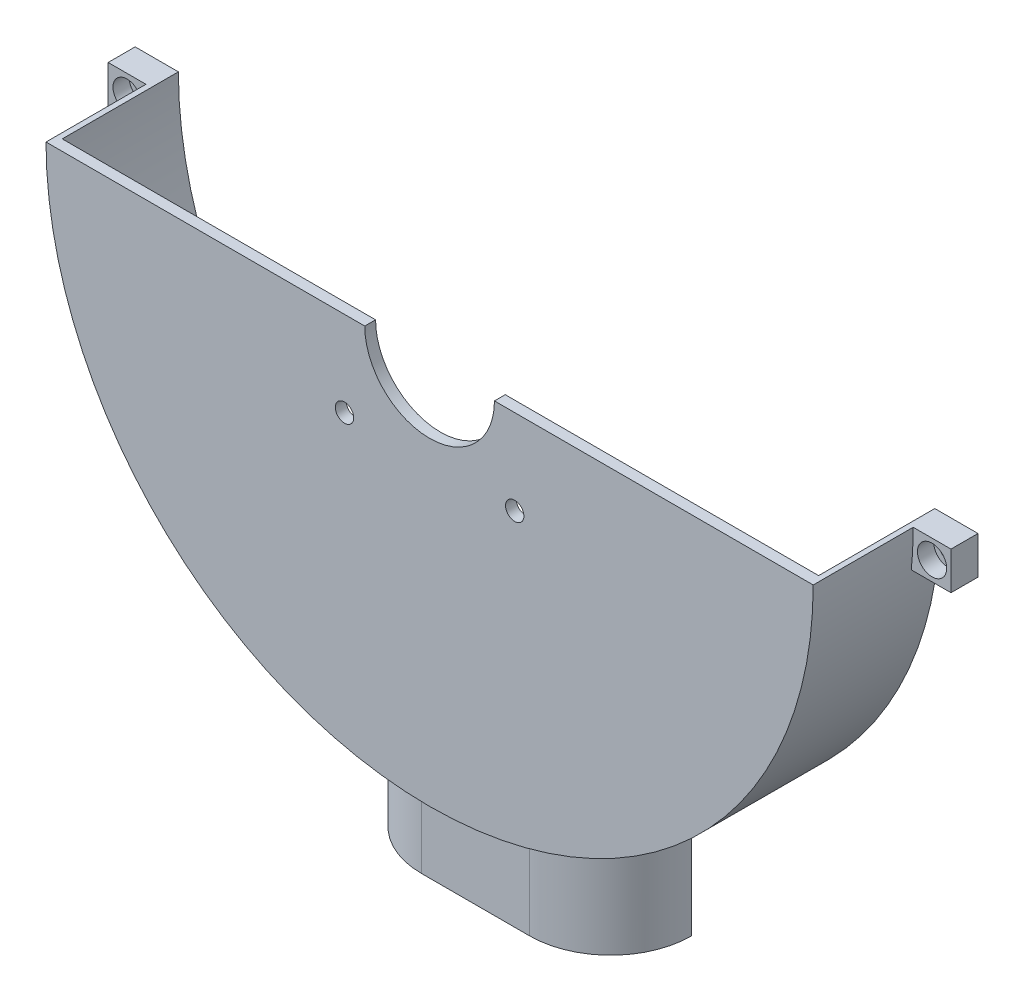
ISO-10303-21;
HEADER;
FILE_DESCRIPTION(('STEP AP214'),'2;1');
FILE_NAME('part.step','',(''),(''),'','','');
FILE_SCHEMA(('AUTOMOTIVE_DESIGN { 1 0 10303 214 1 1 1 1 }'));
ENDSEC;
DATA;
#1=APPLICATION_CONTEXT('core data for automotive mechanical design processes');
#2=APPLICATION_PROTOCOL_DEFINITION('international standard','automotive_design',2000,#1);
#3=PRODUCT_CONTEXT('',#1,'mechanical');
#4=PRODUCT('Part','Part','',(#3));
#5=PRODUCT_RELATED_PRODUCT_CATEGORY('part','',(#4));
#6=PRODUCT_DEFINITION_FORMATION('','',#4);
#7=PRODUCT_DEFINITION_CONTEXT('part definition',#1,'design');
#8=PRODUCT_DEFINITION('design','',#6,#7);
#9=PRODUCT_DEFINITION_SHAPE('','',#8);
#10=(LENGTH_UNIT() NAMED_UNIT(*) SI_UNIT(.MILLI.,.METRE.));
#11=(NAMED_UNIT(*) PLANE_ANGLE_UNIT() SI_UNIT($,.RADIAN.));
#12=(NAMED_UNIT(*) SI_UNIT($,.STERADIAN.) SOLID_ANGLE_UNIT());
#13=UNCERTAINTY_MEASURE_WITH_UNIT(LENGTH_MEASURE(1.E-05),#10,'distance_accuracy_value','');
#14=(GEOMETRIC_REPRESENTATION_CONTEXT(3) GLOBAL_UNCERTAINTY_ASSIGNED_CONTEXT((#13)) GLOBAL_UNIT_ASSIGNED_CONTEXT((#10,
#11,#12)) REPRESENTATION_CONTEXT('',''));
#15=CARTESIAN_POINT('',(0.,0.,0.));
#16=DIRECTION('',(0.,0.,1.));
#17=DIRECTION('',(1.,0.,0.));
#18=AXIS2_PLACEMENT_3D('',#15,#16,#17);
#19=CARTESIAN_POINT('',(0.,0.,21.5));
#20=DIRECTION('',(0.,1.,0.));
#21=DIRECTION('',(-1.,0.,0.));
#22=AXIS2_PLACEMENT_3D('',#19,#20,#21);
#23=PLANE('',#22);
#24=DIRECTION('',(0.,0.,1.));
#25=VECTOR('',#24,1.);
#26=CARTESIAN_POINT('',(-12.,0.,13.5));
#27=LINE('',#26,#25);
#28=CARTESIAN_POINT('',(-12.,0.,21.5));
#29=VERTEX_POINT('',#28);
#30=CARTESIAN_POINT('',(-12.,0.,23.5));
#31=VERTEX_POINT('',#30);
#32=EDGE_CURVE('E131',#29,#31,#27,.T.);
#33=ORIENTED_EDGE('',*,*,#32,.F.);
#34=DIRECTION('',(-1.,0.,0.));
#35=VECTOR('',#34,1.);
#36=CARTESIAN_POINT('',(0.,0.,21.5));
#37=LINE('',#36,#35);
#38=CARTESIAN_POINT('',(-70.,0.,21.5));
#39=VERTEX_POINT('',#38);
#40=EDGE_CURVE('E293',#29,#39,#37,.T.);
#41=ORIENTED_EDGE('',*,*,#40,.T.);
#42=DIRECTION('',(0.,0.,-1.));
#43=VECTOR('',#42,1.);
#44=CARTESIAN_POINT('',(-70.,0.,21.5));
#45=LINE('',#44,#43);
#46=CARTESIAN_POINT('',(-70.,0.,0.));
#47=VERTEX_POINT('',#46);
#48=EDGE_CURVE('E313',#39,#47,#45,.T.);
#49=ORIENTED_EDGE('',*,*,#48,.T.);
#50=DIRECTION('',(1.,0.,0.));
#51=VECTOR('',#50,1.);
#52=CARTESIAN_POINT('',(0.,0.,0.));
#53=LINE('',#52,#51);
#54=CARTESIAN_POINT('',(-78.,0.,0.));
#55=VERTEX_POINT('',#54);
#56=EDGE_CURVE('E300',#55,#47,#53,.T.);
#57=ORIENTED_EDGE('',*,*,#56,.F.);
#58=DIRECTION('',(0.,0.,-1.));
#59=VECTOR('',#58,1.);
#60=CARTESIAN_POINT('',(-78.,0.,5.));
#61=LINE('',#60,#59);
#62=CARTESIAN_POINT('',(-78.,0.,5.));
#63=VERTEX_POINT('',#62);
#64=EDGE_CURVE('E852',#63,#55,#61,.T.);
#65=ORIENTED_EDGE('',*,*,#64,.F.);
#66=DIRECTION('',(-1.,0.,0.));
#67=VECTOR('',#66,1.);
#68=CARTESIAN_POINT('',(-71.,-5.23545925731354E-13,5.));
#69=LINE('',#68,#67);
#70=CARTESIAN_POINT('',(-71.,0.,5.));
#71=VERTEX_POINT('',#70);
#72=EDGE_CURVE('E850',#71,#63,#69,.T.);
#73=ORIENTED_EDGE('',*,*,#72,.F.);
#74=DIRECTION('',(0.,0.,-1.));
#75=VECTOR('',#74,1.);
#76=CARTESIAN_POINT('',(-71.,0.,21.5));
#77=LINE('',#76,#75);
#78=CARTESIAN_POINT('',(-71.,0.,23.5));
#79=VERTEX_POINT('',#78);
#80=EDGE_CURVE('E311',#79,#71,#77,.T.);
#81=ORIENTED_EDGE('',*,*,#80,.F.);
#82=DIRECTION('',(-1.,0.,0.));
#83=VECTOR('',#82,1.);
#84=CARTESIAN_POINT('',(0.,0.,23.5));
#85=LINE('',#84,#83);
#86=EDGE_CURVE('E284',#31,#79,#85,.T.);
#87=ORIENTED_EDGE('',*,*,#86,.F.);
#88=EDGE_LOOP('',(#33,#41,#49,#57,#65,#73,#81,#87));
#89=FACE_BOUND('',#88,.T.);
#90=ADVANCED_FACE('F116',(#89),#23,.T.);
#91=CARTESIAN_POINT('',(0.,0.,0.));
#92=DIRECTION('',(0.,0.,1.));
#93=DIRECTION('',(1.,0.,0.));
#94=AXIS2_PLACEMENT_3D('',#91,#92,#93);
#95=PLANE('',#94);
#96=CARTESIAN_POINT('',(74.5,-3.49999999999999,0.));
#97=DIRECTION('',(0.,0.,-1.));
#98=DIRECTION('',(-1.,0.,0.));
#99=AXIS2_PLACEMENT_3D('',#96,#97,#98);
#100=CIRCLE('',#99,1.60000000000001);
#101=CARTESIAN_POINT('',(72.9,-3.49999999999999,0.));
#102=VERTEX_POINT('',#101);
#103=EDGE_CURVE('E867',#102,#102,#100,.T.);
#104=ORIENTED_EDGE('',*,*,#103,.F.);
#105=EDGE_LOOP('',(#104));
#106=FACE_BOUND('',#105,.T.);
#107=CARTESIAN_POINT('',(-74.5,-3.50000000000002,0.));
#108=DIRECTION('',(0.,0.,1.));
#109=DIRECTION('',(1.,0.,0.));
#110=AXIS2_PLACEMENT_3D('',#107,#108,#109);
#111=CIRCLE('',#110,1.60000000000001);
#112=CARTESIAN_POINT('',(-72.9,-3.50000000000002,0.));
#113=VERTEX_POINT('',#112);
#114=EDGE_CURVE('E323',#113,#113,#111,.T.);
#115=ORIENTED_EDGE('',*,*,#114,.T.);
#116=EDGE_LOOP('',(#115));
#117=FACE_BOUND('',#116,.T.);
#118=DIRECTION('',(0.,-1.,0.));
#119=VECTOR('',#118,1.);
#120=CARTESIAN_POINT('',(21.6189500386222,-71.,0.));
#121=LINE('',#120,#119);
#122=CARTESIAN_POINT('',(21.6189500386222,-71.,0.));
#123=VERTEX_POINT('',#122);
#124=CARTESIAN_POINT('',(21.6189500386222,-91.,0.));
#125=VERTEX_POINT('',#124);
#126=EDGE_CURVE('E939',#123,#125,#121,.T.);
#127=ORIENTED_EDGE('',*,*,#126,.F.);
#128=DIRECTION('',(1.,0.,0.));
#129=VECTOR('',#128,1.);
#130=CARTESIAN_POINT('',(0.,-71.,0.));
#131=LINE('',#130,#129);
#132=CARTESIAN_POINT('',(-21.6189500386223,-71.,0.));
#133=VERTEX_POINT('',#132);
#134=EDGE_CURVE('E971',#133,#123,#131,.T.);
#135=ORIENTED_EDGE('',*,*,#134,.F.);
#136=DIRECTION('',(0.,-1.,0.));
#137=VECTOR('',#136,1.);
#138=CARTESIAN_POINT('',(-21.6189500386223,-71.,0.));
#139=LINE('',#138,#137);
#140=CARTESIAN_POINT('',(-21.6189500386223,-91.,0.));
#141=VERTEX_POINT('',#140);
#142=EDGE_CURVE('E891',#133,#141,#139,.T.);
#143=ORIENTED_EDGE('',*,*,#142,.T.);
#144=DIRECTION('',(-1.,0.,0.));
#145=VECTOR('',#144,1.);
#146=CARTESIAN_POINT('',(0.,-91.,0.));
#147=LINE('',#146,#145);
#148=CARTESIAN_POINT('',(-25.,-91.,0.));
#149=VERTEX_POINT('',#148);
#150=EDGE_CURVE('E879',#141,#149,#147,.T.);
#151=ORIENTED_EDGE('',*,*,#150,.T.);
#152=DIRECTION('',(0.,1.,0.));
#153=VECTOR('',#152,1.);
#154=CARTESIAN_POINT('',(-25.,0.,0.));
#155=LINE('',#154,#153);
#156=CARTESIAN_POINT('',(-25.,-66.4529909033446,0.));
#157=VERTEX_POINT('',#156);
#158=EDGE_CURVE('E289',#149,#157,#155,.T.);
#159=ORIENTED_EDGE('',*,*,#158,.T.);
#160=CARTESIAN_POINT('',(0.,0.,0.));
#161=DIRECTION('',(0.,0.,1.));
#162=DIRECTION('',(1.,0.,0.));
#163=AXIS2_PLACEMENT_3D('',#160,#161,#162);
#164=CIRCLE('',#163,71.);
#165=CARTESIAN_POINT('',(-70.6540869306228,-7.00000000000003,0.));
#166=VERTEX_POINT('',#165);
#167=EDGE_CURVE('E304',#166,#157,#164,.T.);
#168=ORIENTED_EDGE('',*,*,#167,.F.);
#169=DIRECTION('',(1.,0.,0.));
#170=VECTOR('',#169,1.);
#171=CARTESIAN_POINT('',(-73.,-7.00000000000003,0.));
#172=LINE('',#171,#170);
#173=CARTESIAN_POINT('',(-78.,-7.00000000000003,0.));
#174=VERTEX_POINT('',#173);
#175=EDGE_CURVE('E854',#174,#166,#172,.T.);
#176=ORIENTED_EDGE('',*,*,#175,.F.);
#177=DIRECTION('',(0.,-1.,0.));
#178=VECTOR('',#177,1.);
#179=CARTESIAN_POINT('',(-78.,0.,0.));
#180=LINE('',#179,#178);
#181=EDGE_CURVE('E858',#55,#174,#180,.T.);
#182=ORIENTED_EDGE('',*,*,#181,.F.);
#183=ORIENTED_EDGE('',*,*,#56,.T.);
#184=CARTESIAN_POINT('',(0.,0.,0.));
#185=DIRECTION('',(0.,0.,1.));
#186=DIRECTION('',(1.,0.,0.));
#187=AXIS2_PLACEMENT_3D('',#184,#185,#186);
#188=CIRCLE('',#187,70.);
#189=CARTESIAN_POINT('',(70.,0.,0.));
#190=VERTEX_POINT('',#189);
#191=EDGE_CURVE('E286',#47,#190,#188,.T.);
#192=ORIENTED_EDGE('',*,*,#191,.T.);
#193=CARTESIAN_POINT('',(78.,0.,0.));
#194=VERTEX_POINT('',#193);
#195=EDGE_CURVE('E298',#190,#194,#53,.T.);
#196=ORIENTED_EDGE('',*,*,#195,.T.);
#197=DIRECTION('',(0.,-1.,0.));
#198=VECTOR('',#197,1.);
#199=CARTESIAN_POINT('',(78.,0.,0.));
#200=LINE('',#199,#198);
#201=CARTESIAN_POINT('',(78.,-7.,0.));
#202=VERTEX_POINT('',#201);
#203=EDGE_CURVE('E912',#194,#202,#200,.T.);
#204=ORIENTED_EDGE('',*,*,#203,.T.);
#205=DIRECTION('',(-1.,0.,0.));
#206=VECTOR('',#205,1.);
#207=CARTESIAN_POINT('',(0.,-7.,0.));
#208=LINE('',#207,#206);
#209=CARTESIAN_POINT('',(70.6540869306228,-7.,0.));
#210=VERTEX_POINT('',#209);
#211=EDGE_CURVE('E915',#202,#210,#208,.T.);
#212=ORIENTED_EDGE('',*,*,#211,.T.);
#213=CARTESIAN_POINT('',(25.,-66.4529909033446,0.));
#214=VERTEX_POINT('',#213);
#215=EDGE_CURVE('E303',#214,#210,#164,.T.);
#216=ORIENTED_EDGE('',*,*,#215,.F.);
#217=DIRECTION('',(0.,1.,0.));
#218=VECTOR('',#217,1.);
#219=CARTESIAN_POINT('',(25.,0.,0.));
#220=LINE('',#219,#218);
#221=CARTESIAN_POINT('',(25.,-91.,0.));
#222=VERTEX_POINT('',#221);
#223=EDGE_CURVE('E877',#222,#214,#220,.T.);
#224=ORIENTED_EDGE('',*,*,#223,.F.);
#225=EDGE_CURVE('E880',#222,#125,#147,.T.);
#226=ORIENTED_EDGE('',*,*,#225,.T.);
#227=EDGE_LOOP('',(#127,#135,#143,#151,#159,#168,#176,#182,#183,#192,#196,#204,#212,#216,#224,#226));
#228=FACE_BOUND('',#227,.T.);
#229=ADVANCED_FACE('F363',(#106,#117,#228),#95,.F.);
#230=CARTESIAN_POINT('',(0.,-91.,15.));
#231=DIRECTION('',(0.,-1.,0.));
#232=DIRECTION('',(0.,0.,-1.));
#233=AXIS2_PLACEMENT_3D('',#230,#231,#232);
#234=PLANE('',#233);
#235=CARTESIAN_POINT('',(10.,-91.,0.));
#236=DIRECTION('',(0.,-1.,0.));
#237=DIRECTION('',(0.,0.,-1.));
#238=AXIS2_PLACEMENT_3D('',#235,#236,#237);
#239=CIRCLE('',#238,12.);
#240=CARTESIAN_POINT('',(21.6189500386222,-91.,3.));
#241=VERTEX_POINT('',#240);
#242=CARTESIAN_POINT('',(10.,-91.,12.));
#243=VERTEX_POINT('',#242);
#244=EDGE_CURVE('E962',#241,#243,#239,.T.);
#245=ORIENTED_EDGE('',*,*,#244,.F.);
#246=DIRECTION('',(0.,0.,-1.));
#247=VECTOR('',#246,1.);
#248=CARTESIAN_POINT('',(21.6189500386222,-91.,0.));
#249=LINE('',#248,#247);
#250=EDGE_CURVE('E139',#241,#125,#249,.T.);
#251=ORIENTED_EDGE('',*,*,#250,.T.);
#252=ORIENTED_EDGE('',*,*,#225,.F.);
#253=CARTESIAN_POINT('',(10.,-91.,0.));
#254=DIRECTION('',(0.,-1.,0.));
#255=DIRECTION('',(0.,0.,-1.));
#256=AXIS2_PLACEMENT_3D('',#253,#254,#255);
#257=CIRCLE('',#256,15.);
#258=CARTESIAN_POINT('',(10.,-91.,15.));
#259=VERTEX_POINT('',#258);
#260=EDGE_CURVE('E328',#222,#259,#257,.T.);
#261=ORIENTED_EDGE('',*,*,#260,.T.);
#262=DIRECTION('',(-1.,0.,0.));
#263=VECTOR('',#262,1.);
#264=CARTESIAN_POINT('',(0.,-91.,15.));
#265=LINE('',#264,#263);
#266=CARTESIAN_POINT('',(-10.,-91.,15.));
#267=VERTEX_POINT('',#266);
#268=EDGE_CURVE('E871',#259,#267,#265,.T.);
#269=ORIENTED_EDGE('',*,*,#268,.T.);
#270=CARTESIAN_POINT('',(-10.,-91.,0.));
#271=DIRECTION('',(0.,-1.,0.));
#272=DIRECTION('',(0.,0.,-1.));
#273=AXIS2_PLACEMENT_3D('',#270,#271,#272);
#274=CIRCLE('',#273,15.);
#275=EDGE_CURVE('E330',#267,#149,#274,.T.);
#276=ORIENTED_EDGE('',*,*,#275,.T.);
#277=ORIENTED_EDGE('',*,*,#150,.F.);
#278=DIRECTION('',(0.,0.,-1.));
#279=VECTOR('',#278,1.);
#280=CARTESIAN_POINT('',(-21.6189500386223,-91.,0.));
#281=LINE('',#280,#279);
#282=CARTESIAN_POINT('',(-21.6189500386223,-91.,3.));
#283=VERTEX_POINT('',#282);
#284=EDGE_CURVE('E979',#283,#141,#281,.T.);
#285=ORIENTED_EDGE('',*,*,#284,.F.);
#286=CARTESIAN_POINT('',(-10.,-91.,0.));
#287=DIRECTION('',(0.,-1.,0.));
#288=DIRECTION('',(0.,0.,-1.));
#289=AXIS2_PLACEMENT_3D('',#286,#287,#288);
#290=CIRCLE('',#289,12.);
#291=CARTESIAN_POINT('',(-10.,-91.,12.));
#292=VERTEX_POINT('',#291);
#293=EDGE_CURVE('E976',#292,#283,#290,.T.);
#294=ORIENTED_EDGE('',*,*,#293,.F.);
#295=DIRECTION('',(-1.,0.,0.));
#296=VECTOR('',#295,1.);
#297=CARTESIAN_POINT('',(0.,-91.,12.));
#298=LINE('',#297,#296);
#299=EDGE_CURVE('E965',#243,#292,#298,.T.);
#300=ORIENTED_EDGE('',*,*,#299,.F.);
#301=EDGE_LOOP('',(#245,#251,#252,#261,#269,#276,#277,#285,#294,#300));
#302=FACE_BOUND('',#301,.T.);
#303=ADVANCED_FACE('F368',(#302),#234,.T.);
#304=CARTESIAN_POINT('',(-74.5,-3.50000000000002,5.));
#305=DIRECTION('',(0.,0.,-1.));
#306=DIRECTION('',(-1.,0.,0.));
#307=AXIS2_PLACEMENT_3D('',#304,#305,#306);
#308=CYLINDRICAL_SURFACE('',#307,1.60000000000001);
#309=ORIENTED_EDGE('',*,*,#114,.F.);
#310=EDGE_LOOP('',(#309));
#311=FACE_BOUND('',#310,.T.);
#312=CARTESIAN_POINT('',(-74.5,-3.50000000000002,2.));
#313=DIRECTION('',(0.,0.,1.));
#314=DIRECTION('',(1.,0.,0.));
#315=AXIS2_PLACEMENT_3D('',#312,#313,#314);
#316=CIRCLE('',#315,1.60000000000001);
#317=CARTESIAN_POINT('',(-72.9,-3.50000000000002,2.));
#318=VERTEX_POINT('',#317);
#319=EDGE_CURVE('E319',#318,#318,#316,.T.);
#320=ORIENTED_EDGE('',*,*,#319,.T.);
#321=EDGE_LOOP('',(#320));
#322=FACE_BOUND('',#321,.T.);
#323=ADVANCED_FACE('F380',(#311,#322),#308,.F.);
#324=CARTESIAN_POINT('',(74.5,-3.49999999999999,5.));
#325=DIRECTION('',(0.,0.,-1.));
#326=DIRECTION('',(-1.,0.,0.));
#327=AXIS2_PLACEMENT_3D('',#324,#325,#326);
#328=CYLINDRICAL_SURFACE('',#327,1.60000000000001);
#329=ORIENTED_EDGE('',*,*,#103,.T.);
#330=EDGE_LOOP('',(#329));
#331=FACE_BOUND('',#330,.T.);
#332=CARTESIAN_POINT('',(74.5,-3.49999999999999,2.));
#333=DIRECTION('',(0.,0.,1.));
#334=DIRECTION('',(1.,0.,0.));
#335=AXIS2_PLACEMENT_3D('',#332,#333,#334);
#336=CIRCLE('',#335,1.60000000000001);
#337=CARTESIAN_POINT('',(76.1,-3.49999999999999,2.));
#338=VERTEX_POINT('',#337);
#339=EDGE_CURVE('E316',#338,#338,#336,.F.);
#340=ORIENTED_EDGE('',*,*,#339,.F.);
#341=EDGE_LOOP('',(#340));
#342=FACE_BOUND('',#341,.T.);
#343=ADVANCED_FACE('F360',(#331,#342),#328,.F.);
#344=CARTESIAN_POINT('',(0.,0.,21.5));
#345=DIRECTION('',(0.,0.,-1.));
#346=DIRECTION('',(-1.,0.,0.));
#347=AXIS2_PLACEMENT_3D('',#344,#345,#346);
#348=CYLINDRICAL_SURFACE('',#347,71.);
#349=ORIENTED_EDGE('',*,*,#167,.T.);
#350=CARTESIAN_POINT('',(-25.,-66.4529909033446,0.));
#351=CARTESIAN_POINT('',(-25.0000005903524,-66.4529892917345,0.202890123291094));
#352=CARTESIAN_POINT('',(-24.9958827959298,-66.4545399945073,0.405754132783713));
#353=CARTESIAN_POINT('',(-24.9794283711578,-66.4607272766142,0.811094434555971));
#354=CARTESIAN_POINT('',(-24.9670920257694,-66.4653637489557,1.01357074003433));
#355=CARTESIAN_POINT('',(-24.917797028508,-66.4838680768963,1.61974669485583));
#356=CARTESIAN_POINT('',(-24.8685523791685,-66.5023308782734,2.02238403361912));
#357=CARTESIAN_POINT('',(-24.737993198442,-66.5510066828299,2.82038996686675));
#358=CARTESIAN_POINT('',(-24.6567755820139,-66.5811841731827,3.21577678312238));
#359=CARTESIAN_POINT('',(-24.4630499639891,-66.6526056042619,3.99780486330627));
#360=CARTESIAN_POINT('',(-24.3505410103259,-66.6938498817037,4.38444586074817));
#361=CARTESIAN_POINT('',(-24.0953419993637,-66.7864723363784,5.14612284370514));
#362=CARTESIAN_POINT('',(-23.9526689943176,-66.8378447868793,5.52116524936546));
#363=CARTESIAN_POINT('',(-23.638324992462,-66.9496631926846,6.25750406523527));
#364=CARTESIAN_POINT('',(-23.4666523229956,-67.0101096713426,6.61879968107707));
#365=CARTESIAN_POINT('',(-23.0956020324913,-67.1388987831489,7.325612948941));
#366=CARTESIAN_POINT('',(-22.8962112994059,-67.2072451507505,7.67112303022247));
#367=CARTESIAN_POINT('',(-22.4712659315399,-67.3505194327208,8.34421645846842));
#368=CARTESIAN_POINT('',(-22.2457107012023,-67.4254474968928,8.67179939712486));
#369=CARTESIAN_POINT('',(-21.7615525631412,-67.5832961350776,9.31851766812734));
#370=CARTESIAN_POINT('',(-21.5020617801036,-67.6664058484265,9.63694224659087));
#371=CARTESIAN_POINT('',(-20.9583899157298,-67.8367677003514,10.2509462698629));
#372=CARTESIAN_POINT('',(-20.6742009101862,-67.9240211643104,10.5465183247368));
#373=CARTESIAN_POINT('',(-20.0829901748955,-68.1011653816012,11.1130988985723));
#374=CARTESIAN_POINT('',(-19.7759650826353,-68.1910565221346,11.3841037870398));
#375=CARTESIAN_POINT('',(-19.1410012430146,-68.3720048524889,11.8999762900218));
#376=CARTESIAN_POINT('',(-18.8130617028942,-68.4630620864058,12.1448429128263));
#377=CARTESIAN_POINT('',(-18.1218416025611,-68.6493487369842,12.6182231879232));
#378=CARTESIAN_POINT('',(-17.7576183066252,-68.744566193301,12.845366685592));
#379=CARTESIAN_POINT('',(-17.0108165521357,-68.9331587207391,13.2677206815555));
#380=CARTESIAN_POINT('',(-16.6282441960605,-69.0265343900152,13.4629417025938));
#381=CARTESIAN_POINT('',(-15.8472721857437,-69.2100050478546,13.8200473386814));
#382=CARTESIAN_POINT('',(-15.4488785608921,-69.3001012615813,13.9819445105397));
#383=CARTESIAN_POINT('',(-14.6388107248533,-69.4757285989762,14.2711708026575));
#384=CARTESIAN_POINT('',(-14.2271392023012,-69.5612606376462,14.3985068726197));
#385=CARTESIAN_POINT('',(-13.5009067949091,-69.7052730446685,14.5892427530184));
#386=CARTESIAN_POINT('',(-13.1886811773013,-69.7650412692188,14.660662313501));
#387=CARTESIAN_POINT('',(-12.559703961304,-69.881013679575,14.7834554064761));
#388=CARTESIAN_POINT('',(-12.242953253642,-69.9372185552684,14.8348328292425));
#389=CARTESIAN_POINT('',(-11.6062572804768,-70.045691676637,14.9172020304908));
#390=CARTESIAN_POINT('',(-11.2863131375469,-70.0979612540486,14.9482007330017));
#391=CARTESIAN_POINT('',(-10.6443571537927,-70.1983170317084,14.9896100135823));
#392=CARTESIAN_POINT('',(-10.3223447877684,-70.2464021202939,15.0000151365729));
#393=CARTESIAN_POINT('',(-10.,-70.2922470831599,15.));
#394=B_SPLINE_CURVE_WITH_KNOTS('',3,(#350,#351,#352,#353,#354,#355,#356,#357,#358,#359,#360,
#361,#362,#363,#364,#365,#366,#367,#368,#369,#370,#371,#372,#373,#374,#375,#376,#377,#378,#379,
#380,#381,#382,#383,#384,#385,#386,#387,#388,#389,#390,#391,#392,#393),.UNSPECIFIED.,.F.,.F.,(4,
2,2,2,2,2,2,2,2,2,2,2,2,2,2,2,2,2,2,2,2,4),(0.,0.608570725485435,1.21712035115968,
2.43364958759041,3.6465193843696,4.85942608782073,6.07164893913068,7.28394173351149,
8.4968099677002,9.70970581465124,10.9655839571441,12.2218665352263,13.4783344629911,
14.7348500453823,16.052339464034,17.3693937136526,18.6859507698999,20.0022428904329,
20.9790765747016,21.9557205564564,22.9320325344798,23.9086030953595),.UNSPECIFIED.);
#395=CARTESIAN_POINT('',(-10.,-70.2922470831599,15.));
#396=VERTEX_POINT('',#395);
#397=EDGE_CURVE('E333',#157,#396,#394,.T.);
#398=ORIENTED_EDGE('',*,*,#397,.T.);
#399=CARTESIAN_POINT('',(0.,0.,15.));
#400=DIRECTION('',(0.,0.,-1.));
#401=DIRECTION('',(-1.,0.,0.));
#402=AXIS2_PLACEMENT_3D('',#399,#400,#401);
#403=CIRCLE('',#402,71.);
#404=CARTESIAN_POINT('',(10.,-70.2922470831599,15.));
#405=VERTEX_POINT('',#404);
#406=EDGE_CURVE('E874',#405,#396,#403,.T.);
#407=ORIENTED_EDGE('',*,*,#406,.F.);
#408=CARTESIAN_POINT('',(10.,-70.2922470831599,15.));
#409=CARTESIAN_POINT('',(10.2139363859511,-70.2618131813049,14.9999999695141));
#410=CARTESIAN_POINT('',(10.4277051094957,-70.2304036050421,14.9954224227743));
#411=CARTESIAN_POINT('',(10.8545616919083,-70.1656971947847,14.9771615807701));
#412=CARTESIAN_POINT('',(11.0676495677583,-70.1324004082562,14.9634785144299));
#413=CARTESIAN_POINT('',(11.7051948561132,-70.0298043608516,14.9088613094986));
#414=CARTESIAN_POINT('',(12.1281307104455,-69.9577713905516,14.8543590709993));
#415=CARTESIAN_POINT('',(12.9658575720154,-69.8073592833812,14.7099992636987));
#416=CARTESIAN_POINT('',(13.38066245696,-69.7289923927318,14.6202086824519));
#417=CARTESIAN_POINT('',(14.2002005596321,-69.5667218100454,14.4061675282177));
#418=CARTESIAN_POINT('',(14.6049333766161,-69.482817898187,14.2819155864766));
#419=CARTESIAN_POINT('',(15.4014290237364,-69.3106193224046,14.0001054081002));
#420=CARTESIAN_POINT('',(15.7931979514005,-69.2223267730018,13.8425630946279));
#421=CARTESIAN_POINT('',(16.5614840552444,-69.0425442255805,13.4953562211368));
#422=CARTESIAN_POINT('',(16.938000614122,-68.9510540984265,13.3056903626025));
#423=CARTESIAN_POINT('',(17.6735305808308,-68.7661993899087,12.8955148799361));
#424=CARTESIAN_POINT('',(18.032537974225,-68.6728341797823,12.6749947565357));
#425=CARTESIAN_POINT('',(18.7306774207431,-68.4857090970559,12.2046075236882));
#426=CARTESIAN_POINT('',(19.0698091836421,-68.3919492187143,11.9547399858686));
#427=CARTESIAN_POINT('',(19.7333109621519,-68.2035043083046,11.4213751539266));
#428=CARTESIAN_POINT('',(20.0571892910213,-68.1088446037796,11.1372568191024));
#429=CARTESIAN_POINT('',(20.6797377755465,-67.9224119999273,10.541761974096));
#430=CARTESIAN_POINT('',(20.978408146774,-67.8306390759171,10.2303856970631));
#431=CARTESIAN_POINT('',(21.5484605400567,-67.6517045696799,9.58224126580219));
#432=CARTESIAN_POINT('',(21.8198378835186,-67.5645437792779,9.24546877538898));
#433=CARTESIAN_POINT('',(22.3331625384014,-67.3966082376737,8.5487036026553));
#434=CARTESIAN_POINT('',(22.5751109373863,-67.3158332505191,8.18871177917181));
#435=CARTESIAN_POINT('',(23.0255159856525,-67.1630975470954,7.45123442050554));
#436=CARTESIAN_POINT('',(23.2342590464413,-67.0910628877752,7.07393927329259));
#437=CARTESIAN_POINT('',(23.6190459412865,-66.9565697350019,6.30141160948439));
#438=CARTESIAN_POINT('',(23.795092157202,-66.8941105440649,5.90618040208504));
#439=CARTESIAN_POINT('',(24.1126449130714,-66.7803025975163,5.10100870037129));
#440=CARTESIAN_POINT('',(24.2541888866319,-66.7289418074986,4.69108470625582));
#441=CARTESIAN_POINT('',(24.5014780114503,-66.638539031647,3.85944868122548));
#442=CARTESIAN_POINT('',(24.60723609383,-66.5994925964062,3.43774096808075));
#443=CARTESIAN_POINT('',(24.7958654854792,-66.5295194123323,2.51729050082726));
#444=CARTESIAN_POINT('',(24.8723544259504,-66.5008961545058,2.01703122498264));
#445=CARTESIAN_POINT('',(24.9488991574379,-66.4721976200543,1.26268578907946));
#446=CARTESIAN_POINT('',(24.9680492680456,-66.4650041891141,1.01064489386477));
#447=CARTESIAN_POINT('',(24.9936017649907,-66.4553984058687,0.505754579709946));
#448=CARTESIAN_POINT('',(25.000000495831,-66.4529874245715,0.252904949727254));
#449=CARTESIAN_POINT('',(25.,-66.4529909033446,0.));
#450=B_SPLINE_CURVE_WITH_KNOTS('',3,(#408,#409,#410,#411,#412,#413,#414,#415,#416,#417,#418,
#419,#420,#421,#422,#423,#424,#425,#426,#427,#428,#429,#430,#431,#432,#433,#434,#435,#436,#437,
#438,#439,#440,#441,#442,#443,#444,#445,#446,#447,#448,#449),.UNSPECIFIED.,.F.,.F.,(4,2,2,2,2,2,
2,2,2,2,2,2,2,2,2,2,2,2,2,2,4),(0.,0.648163931239846,1.2963115674376,2.59201254012226,
3.88526568393931,5.17857020120226,6.47125751081972,7.76399708662323,9.05717763808697,
10.350377067933,11.6721482407039,12.9939081088883,14.31589416942,15.6378313603238,
16.9476628861356,18.2573989575104,19.5657076266864,20.8735430364311,22.3909334861488,
23.1492287751872,23.9077414170007),.UNSPECIFIED.);
#451=EDGE_CURVE('E125',#405,#214,#450,.T.);
#452=ORIENTED_EDGE('',*,*,#451,.T.);
#453=ORIENTED_EDGE('',*,*,#215,.T.);
#454=DIRECTION('',(0.,0.,-1.));
#455=VECTOR('',#454,1.);
#456=CARTESIAN_POINT('',(70.6540869306228,-7.,5.));
#457=LINE('',#456,#455);
#458=CARTESIAN_POINT('',(70.6540869306228,-7.,5.));
#459=VERTEX_POINT('',#458);
#460=EDGE_CURVE('E928',#459,#210,#457,.T.);
#461=ORIENTED_EDGE('',*,*,#460,.F.);
#462=CARTESIAN_POINT('',(0.,0.,5.));
#463=DIRECTION('',(0.,0.,-1.));
#464=DIRECTION('',(-1.,0.,0.));
#465=AXIS2_PLACEMENT_3D('',#462,#463,#464);
#466=CIRCLE('',#465,71.);
#467=CARTESIAN_POINT('',(71.,0.,5.));
#468=VERTEX_POINT('',#467);
#469=EDGE_CURVE('E869',#468,#459,#466,.T.);
#470=ORIENTED_EDGE('',*,*,#469,.F.);
#471=DIRECTION('',(0.,0.,-1.));
#472=VECTOR('',#471,1.);
#473=CARTESIAN_POINT('',(71.,0.,21.5));
#474=LINE('',#473,#472);
#475=CARTESIAN_POINT('',(71.,0.,23.5));
#476=VERTEX_POINT('',#475);
#477=EDGE_CURVE('E309',#476,#468,#474,.T.);
#478=ORIENTED_EDGE('',*,*,#477,.F.);
#479=CARTESIAN_POINT('',(0.,0.,23.5));
#480=DIRECTION('',(0.,0.,1.));
#481=DIRECTION('',(1.,0.,0.));
#482=AXIS2_PLACEMENT_3D('',#479,#480,#481);
#483=CIRCLE('',#482,71.);
#484=EDGE_CURVE('E283',#79,#476,#483,.T.);
#485=ORIENTED_EDGE('',*,*,#484,.F.);
#486=ORIENTED_EDGE('',*,*,#80,.T.);
#487=CARTESIAN_POINT('',(-70.6540869306228,-7.00000000000003,5.));
#488=VERTEX_POINT('',#487);
#489=EDGE_CURVE('E843',#488,#71,#466,.T.);
#490=ORIENTED_EDGE('',*,*,#489,.F.);
#491=DIRECTION('',(0.,0.,-1.));
#492=VECTOR('',#491,1.);
#493=CARTESIAN_POINT('',(-70.6540869306228,-7.00000000000003,5.));
#494=LINE('',#493,#492);
#495=EDGE_CURVE('E898',#488,#166,#494,.T.);
#496=ORIENTED_EDGE('',*,*,#495,.T.);
#497=EDGE_LOOP('',(#349,#398,#407,#452,#453,#461,#470,#478,#485,#486,#490,#496));
#498=FACE_BOUND('',#497,.T.);
#499=ADVANCED_FACE('F343',(#498),#348,.T.);
#500=CARTESIAN_POINT('',(0.,0.,21.5));
#501=DIRECTION('',(0.,0.,-1.));
#502=DIRECTION('',(-1.,0.,0.));
#503=AXIS2_PLACEMENT_3D('',#500,#501,#502);
#504=CYLINDRICAL_SURFACE('',#503,70.);
#505=DIRECTION('',(0.,0.,-1.));
#506=VECTOR('',#505,1.);
#507=CARTESIAN_POINT('',(70.,0.,21.5));
#508=LINE('',#507,#506);
#509=CARTESIAN_POINT('',(70.,0.,21.5));
#510=VERTEX_POINT('',#509);
#511=EDGE_CURVE('E297',#510,#190,#508,.T.);
#512=ORIENTED_EDGE('',*,*,#511,.T.);
#513=ORIENTED_EDGE('',*,*,#191,.F.);
#514=ORIENTED_EDGE('',*,*,#48,.F.);
#515=CARTESIAN_POINT('',(0.,0.,21.5));
#516=DIRECTION('',(0.,0.,1.));
#517=DIRECTION('',(1.,0.,0.));
#518=AXIS2_PLACEMENT_3D('',#515,#516,#517);
#519=CIRCLE('',#518,70.);
#520=EDGE_CURVE('E294',#39,#510,#519,.T.);
#521=ORIENTED_EDGE('',*,*,#520,.T.);
#522=EDGE_LOOP('',(#512,#513,#514,#521));
#523=FACE_BOUND('',#522,.T.);
#524=ADVANCED_FACE('F352',(#523),#504,.F.);
#525=DIRECTION('',(0.,0.,1.));
#526=VECTOR('',#525,1.);
#527=CARTESIAN_POINT('',(12.,0.,13.5));
#528=LINE('',#527,#526);
#529=CARTESIAN_POINT('',(12.,0.,23.5));
#530=VERTEX_POINT('',#529);
#531=CARTESIAN_POINT('',(12.,0.,21.5));
#532=VERTEX_POINT('',#531);
#533=EDGE_CURVE('E264',#530,#532,#528,.F.);
#534=ORIENTED_EDGE('',*,*,#533,.F.);
#535=EDGE_CURVE('E274',#476,#530,#85,.T.);
#536=ORIENTED_EDGE('',*,*,#535,.F.);
#537=ORIENTED_EDGE('',*,*,#477,.T.);
#538=DIRECTION('',(1.,0.,0.));
#539=VECTOR('',#538,1.);
#540=CARTESIAN_POINT('',(0.,-5.51582605187271E-12,5.));
#541=LINE('',#540,#539);
#542=CARTESIAN_POINT('',(78.,0.,5.));
#543=VERTEX_POINT('',#542);
#544=EDGE_CURVE('E920',#468,#543,#541,.T.);
#545=ORIENTED_EDGE('',*,*,#544,.T.);
#546=DIRECTION('',(0.,0.,-1.));
#547=VECTOR('',#546,1.);
#548=CARTESIAN_POINT('',(78.,0.,5.));
#549=LINE('',#548,#547);
#550=EDGE_CURVE('E908',#543,#194,#549,.T.);
#551=ORIENTED_EDGE('',*,*,#550,.T.);
#552=ORIENTED_EDGE('',*,*,#195,.F.);
#553=ORIENTED_EDGE('',*,*,#511,.F.);
#554=EDGE_CURVE('E276',#510,#532,#37,.T.);
#555=ORIENTED_EDGE('',*,*,#554,.T.);
#556=EDGE_LOOP('',(#534,#536,#537,#545,#551,#552,#553,#555));
#557=FACE_BOUND('',#556,.T.);
#558=ADVANCED_FACE('F272',(#557),#23,.T.);
#559=CARTESIAN_POINT('',(0.,0.,21.5));
#560=DIRECTION('',(0.,0.,1.));
#561=DIRECTION('',(1.,0.,0.));
#562=AXIS2_PLACEMENT_3D('',#559,#560,#561);
#563=PLANE('',#562);
#564=CARTESIAN_POINT('',(-15.75,-15.75,21.5));
#565=DIRECTION('',(0.,0.,1.));
#566=DIRECTION('',(1.,0.,0.));
#567=AXIS2_PLACEMENT_3D('',#564,#565,#566);
#568=CIRCLE('',#567,1.7);
#569=CARTESIAN_POINT('',(-14.05,-15.75,21.5));
#570=VERTEX_POINT('',#569);
#571=EDGE_CURVE('E963',#570,#570,#568,.T.);
#572=ORIENTED_EDGE('',*,*,#571,.T.);
#573=EDGE_LOOP('',(#572));
#574=FACE_BOUND('',#573,.T.);
#575=CARTESIAN_POINT('',(15.75,-15.75,21.5));
#576=DIRECTION('',(0.,0.,1.));
#577=DIRECTION('',(1.,0.,0.));
#578=AXIS2_PLACEMENT_3D('',#575,#576,#577);
#579=CIRCLE('',#578,1.7);
#580=CARTESIAN_POINT('',(17.45,-15.75,21.5));
#581=VERTEX_POINT('',#580);
#582=EDGE_CURVE('E968',#581,#581,#579,.T.);
#583=ORIENTED_EDGE('',*,*,#582,.T.);
#584=EDGE_LOOP('',(#583));
#585=FACE_BOUND('',#584,.T.);
#586=ORIENTED_EDGE('',*,*,#40,.F.);
#587=CARTESIAN_POINT('',(0.,0.,21.5));
#588=DIRECTION('',(0.,0.,1.));
#589=DIRECTION('',(1.,0.,0.));
#590=AXIS2_PLACEMENT_3D('',#587,#588,#589);
#591=CIRCLE('',#590,12.);
#592=EDGE_CURVE('E277',#29,#532,#591,.T.);
#593=ORIENTED_EDGE('',*,*,#592,.T.);
#594=ORIENTED_EDGE('',*,*,#554,.F.);
#595=ORIENTED_EDGE('',*,*,#520,.F.);
#596=EDGE_LOOP('',(#586,#593,#594,#595));
#597=FACE_BOUND('',#596,.T.);
#598=ADVANCED_FACE('F359',(#574,#585,#597),#563,.F.);
#599=CARTESIAN_POINT('',(0.,0.,23.5));
#600=DIRECTION('',(0.,0.,1.));
#601=DIRECTION('',(1.,0.,0.));
#602=AXIS2_PLACEMENT_3D('',#599,#600,#601);
#603=PLANE('',#602);
#604=CARTESIAN_POINT('',(0.,0.,23.5));
#605=DIRECTION('',(0.,0.,1.));
#606=DIRECTION('',(1.,0.,0.));
#607=AXIS2_PLACEMENT_3D('',#604,#605,#606);
#608=CIRCLE('',#607,12.);
#609=EDGE_CURVE('E12',#31,#530,#608,.T.);
#610=ORIENTED_EDGE('',*,*,#609,.F.);
#611=ORIENTED_EDGE('',*,*,#86,.T.);
#612=ORIENTED_EDGE('',*,*,#484,.T.);
#613=ORIENTED_EDGE('',*,*,#535,.T.);
#614=EDGE_LOOP('',(#610,#611,#612,#613));
#615=FACE_BOUND('',#614,.T.);
#616=CARTESIAN_POINT('',(-15.75,-15.75,23.5));
#617=DIRECTION('',(0.,0.,1.));
#618=DIRECTION('',(1.,0.,0.));
#619=AXIS2_PLACEMENT_3D('',#616,#617,#618);
#620=CIRCLE('',#619,1.7);
#621=CARTESIAN_POINT('',(-14.05,-15.75,23.5));
#622=VERTEX_POINT('',#621);
#623=EDGE_CURVE('E1015',#622,#622,#620,.T.);
#624=ORIENTED_EDGE('',*,*,#623,.F.);
#625=EDGE_LOOP('',(#624));
#626=FACE_BOUND('',#625,.T.);
#627=CARTESIAN_POINT('',(15.75,-15.75,23.5));
#628=DIRECTION('',(0.,0.,1.));
#629=DIRECTION('',(1.,0.,0.));
#630=AXIS2_PLACEMENT_3D('',#627,#628,#629);
#631=CIRCLE('',#630,1.7);
#632=CARTESIAN_POINT('',(17.45,-15.75,23.5));
#633=VERTEX_POINT('',#632);
#634=EDGE_CURVE('E1016',#633,#633,#631,.T.);
#635=ORIENTED_EDGE('',*,*,#634,.F.);
#636=EDGE_LOOP('',(#635));
#637=FACE_BOUND('',#636,.T.);
#638=ADVANCED_FACE('F280',(#615,#626,#637),#603,.T.);
#639=CARTESIAN_POINT('',(0.,0.,15.));
#640=DIRECTION('',(0.,0.,-1.));
#641=DIRECTION('',(-1.,0.,0.));
#642=AXIS2_PLACEMENT_3D('',#639,#640,#641);
#643=PLANE('',#642);
#644=ORIENTED_EDGE('',*,*,#406,.T.);
#645=DIRECTION('',(0.,1.,0.));
#646=VECTOR('',#645,1.);
#647=CARTESIAN_POINT('',(-10.,-91.,15.));
#648=LINE('',#647,#646);
#649=EDGE_CURVE('E326',#396,#267,#648,.F.);
#650=ORIENTED_EDGE('',*,*,#649,.T.);
#651=ORIENTED_EDGE('',*,*,#268,.F.);
#652=DIRECTION('',(0.,1.,0.));
#653=VECTOR('',#652,1.);
#654=CARTESIAN_POINT('',(10.,0.,15.));
#655=LINE('',#654,#653);
#656=EDGE_CURVE('E315',#259,#405,#655,.T.);
#657=ORIENTED_EDGE('',*,*,#656,.T.);
#658=EDGE_LOOP('',(#644,#650,#651,#657));
#659=FACE_BOUND('',#658,.T.);
#660=ADVANCED_FACE('F377',(#659),#643,.F.);
#661=CARTESIAN_POINT('',(-78.,0.,5.));
#662=DIRECTION('',(1.,0.,0.));
#663=DIRECTION('',(0.,0.,-1.));
#664=AXIS2_PLACEMENT_3D('',#661,#662,#663);
#665=PLANE('',#664);
#666=ORIENTED_EDGE('',*,*,#181,.T.);
#667=DIRECTION('',(0.,0.,-1.));
#668=VECTOR('',#667,1.);
#669=CARTESIAN_POINT('',(-78.,-7.00000000000003,5.));
#670=LINE('',#669,#668);
#671=CARTESIAN_POINT('',(-78.,-7.00000000000003,5.));
#672=VERTEX_POINT('',#671);
#673=EDGE_CURVE('E865',#672,#174,#670,.T.);
#674=ORIENTED_EDGE('',*,*,#673,.F.);
#675=DIRECTION('',(0.,-1.,0.));
#676=VECTOR('',#675,1.);
#677=CARTESIAN_POINT('',(-78.,0.,5.));
#678=LINE('',#677,#676);
#679=EDGE_CURVE('E846',#63,#672,#678,.T.);
#680=ORIENTED_EDGE('',*,*,#679,.F.);
#681=ORIENTED_EDGE('',*,*,#64,.T.);
#682=EDGE_LOOP('',(#666,#674,#680,#681));
#683=FACE_BOUND('',#682,.T.);
#684=ADVANCED_FACE('F384',(#683),#665,.F.);
#685=CARTESIAN_POINT('',(-73.,-7.00000000000003,5.));
#686=DIRECTION('',(0.,1.,0.));
#687=DIRECTION('',(-1.,0.,0.));
#688=AXIS2_PLACEMENT_3D('',#685,#686,#687);
#689=PLANE('',#688);
#690=ORIENTED_EDGE('',*,*,#495,.F.);
#691=DIRECTION('',(-1.,0.,0.));
#692=VECTOR('',#691,1.);
#693=CARTESIAN_POINT('',(-73.,-7.00000000000003,5.));
#694=LINE('',#693,#692);
#695=EDGE_CURVE('E842',#488,#672,#694,.T.);
#696=ORIENTED_EDGE('',*,*,#695,.T.);
#697=ORIENTED_EDGE('',*,*,#673,.T.);
#698=ORIENTED_EDGE('',*,*,#175,.T.);
#699=EDGE_LOOP('',(#690,#696,#697,#698));
#700=FACE_BOUND('',#699,.T.);
#701=ADVANCED_FACE('F388',(#700),#689,.F.);
#702=CARTESIAN_POINT('',(0.,0.,5.));
#703=DIRECTION('',(0.,0.,-1.));
#704=DIRECTION('',(-1.,0.,0.));
#705=AXIS2_PLACEMENT_3D('',#702,#703,#704);
#706=PLANE('',#705);
#707=CARTESIAN_POINT('',(-74.5,-3.50000000000002,5.));
#708=DIRECTION('',(0.,0.,1.));
#709=DIRECTION('',(1.,0.,0.));
#710=AXIS2_PLACEMENT_3D('',#707,#708,#709);
#711=CIRCLE('',#710,2.6);
#712=CARTESIAN_POINT('',(-71.9,-3.50000000000002,5.));
#713=VERTEX_POINT('',#712);
#714=EDGE_CURVE('E838',#713,#713,#711,.T.);
#715=ORIENTED_EDGE('',*,*,#714,.F.);
#716=EDGE_LOOP('',(#715));
#717=FACE_BOUND('',#716,.T.);
#718=ORIENTED_EDGE('',*,*,#695,.F.);
#719=ORIENTED_EDGE('',*,*,#489,.T.);
#720=ORIENTED_EDGE('',*,*,#72,.T.);
#721=ORIENTED_EDGE('',*,*,#679,.T.);
#722=EDGE_LOOP('',(#718,#719,#720,#721));
#723=FACE_BOUND('',#722,.T.);
#724=ADVANCED_FACE('F392',(#717,#723),#706,.F.);
#725=CARTESIAN_POINT('',(74.5,-3.49999999999999,5.));
#726=DIRECTION('',(0.,0.,1.));
#727=DIRECTION('',(1.,0.,0.));
#728=AXIS2_PLACEMENT_3D('',#725,#726,#727);
#729=CIRCLE('',#728,2.7);
#730=CARTESIAN_POINT('',(77.2,-3.49999999999999,5.));
#731=VERTEX_POINT('',#730);
#732=EDGE_CURVE('E941',#731,#731,#729,.T.);
#733=ORIENTED_EDGE('',*,*,#732,.F.);
#734=EDGE_LOOP('',(#733));
#735=FACE_BOUND('',#734,.T.);
#736=ORIENTED_EDGE('',*,*,#544,.F.);
#737=ORIENTED_EDGE('',*,*,#469,.T.);
#738=DIRECTION('',(-1.,0.,0.));
#739=VECTOR('',#738,1.);
#740=CARTESIAN_POINT('',(0.,-7.,5.));
#741=LINE('',#740,#739);
#742=CARTESIAN_POINT('',(78.,-7.,5.));
#743=VERTEX_POINT('',#742);
#744=EDGE_CURVE('E917',#743,#459,#741,.T.);
#745=ORIENTED_EDGE('',*,*,#744,.F.);
#746=DIRECTION('',(0.,-1.,0.));
#747=VECTOR('',#746,1.);
#748=CARTESIAN_POINT('',(78.,0.,5.));
#749=LINE('',#748,#747);
#750=EDGE_CURVE('E929',#543,#743,#749,.T.);
#751=ORIENTED_EDGE('',*,*,#750,.F.);
#752=EDGE_LOOP('',(#736,#737,#745,#751));
#753=FACE_BOUND('',#752,.T.);
#754=ADVANCED_FACE('F408',(#735,#753),#706,.F.);
#755=CARTESIAN_POINT('',(78.,0.,5.));
#756=DIRECTION('',(1.,0.,0.));
#757=DIRECTION('',(0.,0.,-1.));
#758=AXIS2_PLACEMENT_3D('',#755,#756,#757);
#759=PLANE('',#758);
#760=ORIENTED_EDGE('',*,*,#203,.F.);
#761=ORIENTED_EDGE('',*,*,#550,.F.);
#762=ORIENTED_EDGE('',*,*,#750,.T.);
#763=DIRECTION('',(0.,0.,-1.));
#764=VECTOR('',#763,1.);
#765=CARTESIAN_POINT('',(78.,-7.,5.));
#766=LINE('',#765,#764);
#767=EDGE_CURVE('E870',#743,#202,#766,.T.);
#768=ORIENTED_EDGE('',*,*,#767,.T.);
#769=EDGE_LOOP('',(#760,#761,#762,#768));
#770=FACE_BOUND('',#769,.T.);
#771=ADVANCED_FACE('F404',(#770),#759,.T.);
#772=CARTESIAN_POINT('',(0.,-7.,5.));
#773=DIRECTION('',(0.,-1.,0.));
#774=DIRECTION('',(0.,0.,-1.));
#775=AXIS2_PLACEMENT_3D('',#772,#773,#774);
#776=PLANE('',#775);
#777=ORIENTED_EDGE('',*,*,#211,.F.);
#778=ORIENTED_EDGE('',*,*,#767,.F.);
#779=ORIENTED_EDGE('',*,*,#744,.T.);
#780=ORIENTED_EDGE('',*,*,#460,.T.);
#781=EDGE_LOOP('',(#777,#778,#779,#780));
#782=FACE_BOUND('',#781,.T.);
#783=ADVANCED_FACE('F400',(#782),#776,.T.);
#784=CARTESIAN_POINT('',(74.5,-3.49999999999999,2.));
#785=DIRECTION('',(0.,0.,1.));
#786=DIRECTION('',(1.,0.,0.));
#787=AXIS2_PLACEMENT_3D('',#784,#785,#786);
#788=PLANE('',#787);
#789=CARTESIAN_POINT('',(74.5,-3.49999999999999,2.));
#790=DIRECTION('',(0.,0.,1.));
#791=DIRECTION('',(1.,0.,0.));
#792=AXIS2_PLACEMENT_3D('',#789,#790,#791);
#793=CIRCLE('',#792,2.7);
#794=CARTESIAN_POINT('',(77.2,-3.49999999999999,2.));
#795=VERTEX_POINT('',#794);
#796=EDGE_CURVE('E320',#795,#795,#793,.T.);
#797=ORIENTED_EDGE('',*,*,#796,.T.);
#798=EDGE_LOOP('',(#797));
#799=FACE_BOUND('',#798,.T.);
#800=ORIENTED_EDGE('',*,*,#339,.T.);
#801=EDGE_LOOP('',(#800));
#802=FACE_BOUND('',#801,.T.);
#803=ADVANCED_FACE('F403',(#799,#802),#788,.T.);
#804=CARTESIAN_POINT('',(74.5,-3.49999999999999,2.));
#805=DIRECTION('',(0.,0.,1.));
#806=DIRECTION('',(1.,0.,0.));
#807=AXIS2_PLACEMENT_3D('',#804,#805,#806);
#808=CYLINDRICAL_SURFACE('',#807,2.7);
#809=ORIENTED_EDGE('',*,*,#796,.F.);
#810=EDGE_LOOP('',(#809));
#811=FACE_BOUND('',#810,.T.);
#812=ORIENTED_EDGE('',*,*,#732,.T.);
#813=EDGE_LOOP('',(#812));
#814=FACE_BOUND('',#813,.T.);
#815=ADVANCED_FACE('F419',(#811,#814),#808,.F.);
#816=CARTESIAN_POINT('',(-74.5,-3.50000000000002,2.));
#817=DIRECTION('',(0.,0.,1.));
#818=DIRECTION('',(1.,0.,0.));
#819=AXIS2_PLACEMENT_3D('',#816,#817,#818);
#820=CYLINDRICAL_SURFACE('',#819,2.6);
#821=CARTESIAN_POINT('',(-74.5,-3.50000000000002,2.));
#822=DIRECTION('',(0.,0.,1.));
#823=DIRECTION('',(1.,0.,0.));
#824=AXIS2_PLACEMENT_3D('',#821,#822,#823);
#825=CIRCLE('',#824,2.6);
#826=CARTESIAN_POINT('',(-71.9,-3.50000000000002,2.));
#827=VERTEX_POINT('',#826);
#828=EDGE_CURVE('E938',#827,#827,#825,.T.);
#829=ORIENTED_EDGE('',*,*,#828,.F.);
#830=EDGE_LOOP('',(#829));
#831=FACE_BOUND('',#830,.T.);
#832=ORIENTED_EDGE('',*,*,#714,.T.);
#833=EDGE_LOOP('',(#832));
#834=FACE_BOUND('',#833,.T.);
#835=ADVANCED_FACE('F415',(#831,#834),#820,.F.);
#836=CARTESIAN_POINT('',(-74.5,-3.50000000000002,2.));
#837=DIRECTION('',(0.,0.,1.));
#838=DIRECTION('',(1.,0.,0.));
#839=AXIS2_PLACEMENT_3D('',#836,#837,#838);
#840=PLANE('',#839);
#841=ORIENTED_EDGE('',*,*,#319,.F.);
#842=EDGE_LOOP('',(#841));
#843=FACE_BOUND('',#842,.T.);
#844=ORIENTED_EDGE('',*,*,#828,.T.);
#845=EDGE_LOOP('',(#844));
#846=FACE_BOUND('',#845,.T.);
#847=ADVANCED_FACE('F350',(#843,#846),#840,.T.);
#848=CARTESIAN_POINT('',(-10.,0.,0.));
#849=DIRECTION('',(0.,-1.,0.));
#850=DIRECTION('',(0.,0.,-1.));
#851=AXIS2_PLACEMENT_3D('',#848,#849,#850);
#852=CYLINDRICAL_SURFACE('',#851,15.);
#853=ORIENTED_EDGE('',*,*,#275,.F.);
#854=ORIENTED_EDGE('',*,*,#649,.F.);
#855=ORIENTED_EDGE('',*,*,#397,.F.);
#856=ORIENTED_EDGE('',*,*,#158,.F.);
#857=EDGE_LOOP('',(#853,#854,#855,#856));
#858=FACE_BOUND('',#857,.T.);
#859=ADVANCED_FACE('F347',(#858),#852,.T.);
#860=CARTESIAN_POINT('',(10.,0.,0.));
#861=DIRECTION('',(0.,1.,0.));
#862=DIRECTION('',(0.,0.,1.));
#863=AXIS2_PLACEMENT_3D('',#860,#861,#862);
#864=CYLINDRICAL_SURFACE('',#863,15.);
#865=ORIENTED_EDGE('',*,*,#260,.F.);
#866=ORIENTED_EDGE('',*,*,#223,.T.);
#867=ORIENTED_EDGE('',*,*,#451,.F.);
#868=ORIENTED_EDGE('',*,*,#656,.F.);
#869=EDGE_LOOP('',(#865,#866,#867,#868));
#870=FACE_BOUND('',#869,.T.);
#871=ADVANCED_FACE('F118',(#870),#864,.T.);
#872=CARTESIAN_POINT('',(21.6189500386222,-71.,0.));
#873=DIRECTION('',(-1.,0.,0.));
#874=DIRECTION('',(0.,0.,1.));
#875=AXIS2_PLACEMENT_3D('',#872,#873,#874);
#876=PLANE('',#875);
#877=ORIENTED_EDGE('',*,*,#250,.F.);
#878=DIRECTION('',(0.,-1.,0.));
#879=VECTOR('',#878,1.);
#880=CARTESIAN_POINT('',(21.6189500386222,-71.,3.));
#881=LINE('',#880,#879);
#882=CARTESIAN_POINT('',(21.6189500386222,-71.,3.));
#883=VERTEX_POINT('',#882);
#884=EDGE_CURVE('E989',#883,#241,#881,.T.);
#885=ORIENTED_EDGE('',*,*,#884,.F.);
#886=DIRECTION('',(0.,0.,-1.));
#887=VECTOR('',#886,1.);
#888=CARTESIAN_POINT('',(21.6189500386222,-71.,0.));
#889=LINE('',#888,#887);
#890=EDGE_CURVE('E980',#883,#123,#889,.T.);
#891=ORIENTED_EDGE('',*,*,#890,.T.);
#892=ORIENTED_EDGE('',*,*,#126,.T.);
#893=EDGE_LOOP('',(#877,#885,#891,#892));
#894=FACE_BOUND('',#893,.T.);
#895=ADVANCED_FACE('F427',(#894),#876,.T.);
#896=CARTESIAN_POINT('',(-21.6189500386223,-71.,0.));
#897=DIRECTION('',(-1.,0.,0.));
#898=DIRECTION('',(0.,0.,1.));
#899=AXIS2_PLACEMENT_3D('',#896,#897,#898);
#900=PLANE('',#899);
#901=ORIENTED_EDGE('',*,*,#284,.T.);
#902=ORIENTED_EDGE('',*,*,#142,.F.);
#903=DIRECTION('',(0.,0.,-1.));
#904=VECTOR('',#903,1.);
#905=CARTESIAN_POINT('',(-21.6189500386223,-71.,0.));
#906=LINE('',#905,#904);
#907=CARTESIAN_POINT('',(-21.6189500386223,-71.,3.));
#908=VERTEX_POINT('',#907);
#909=EDGE_CURVE('E998',#908,#133,#906,.T.);
#910=ORIENTED_EDGE('',*,*,#909,.F.);
#911=DIRECTION('',(0.,-1.,0.));
#912=VECTOR('',#911,1.);
#913=CARTESIAN_POINT('',(-21.6189500386223,-71.,3.));
#914=LINE('',#913,#912);
#915=EDGE_CURVE('E983',#908,#283,#914,.T.);
#916=ORIENTED_EDGE('',*,*,#915,.T.);
#917=EDGE_LOOP('',(#901,#902,#910,#916));
#918=FACE_BOUND('',#917,.T.);
#919=ADVANCED_FACE('F430',(#918),#900,.F.);
#920=CARTESIAN_POINT('',(-10.,-71.,0.));
#921=DIRECTION('',(0.,-1.,0.));
#922=DIRECTION('',(0.,0.,-1.));
#923=AXIS2_PLACEMENT_3D('',#920,#921,#922);
#924=CYLINDRICAL_SURFACE('',#923,12.);
#925=ORIENTED_EDGE('',*,*,#293,.T.);
#926=ORIENTED_EDGE('',*,*,#915,.F.);
#927=CARTESIAN_POINT('',(-10.,-71.,0.));
#928=DIRECTION('',(0.,-1.,0.));
#929=DIRECTION('',(0.,0.,-1.));
#930=AXIS2_PLACEMENT_3D('',#927,#928,#929);
#931=CIRCLE('',#930,12.);
#932=CARTESIAN_POINT('',(-10.,-71.,12.));
#933=VERTEX_POINT('',#932);
#934=EDGE_CURVE('E1001',#933,#908,#931,.T.);
#935=ORIENTED_EDGE('',*,*,#934,.F.);
#936=DIRECTION('',(0.,-1.,0.));
#937=VECTOR('',#936,1.);
#938=CARTESIAN_POINT('',(-10.,-71.,12.));
#939=LINE('',#938,#937);
#940=EDGE_CURVE('E985',#933,#292,#939,.T.);
#941=ORIENTED_EDGE('',*,*,#940,.T.);
#942=EDGE_LOOP('',(#925,#926,#935,#941));
#943=FACE_BOUND('',#942,.T.);
#944=ADVANCED_FACE('F439',(#943),#924,.F.);
#945=CARTESIAN_POINT('',(0.,-71.,12.));
#946=DIRECTION('',(0.,0.,1.));
#947=DIRECTION('',(1.,0.,0.));
#948=AXIS2_PLACEMENT_3D('',#945,#946,#947);
#949=PLANE('',#948);
#950=ORIENTED_EDGE('',*,*,#299,.T.);
#951=ORIENTED_EDGE('',*,*,#940,.F.);
#952=DIRECTION('',(-1.,0.,0.));
#953=VECTOR('',#952,1.);
#954=CARTESIAN_POINT('',(0.,-71.,12.));
#955=LINE('',#954,#953);
#956=CARTESIAN_POINT('',(10.,-71.,12.));
#957=VERTEX_POINT('',#956);
#958=EDGE_CURVE('E1004',#957,#933,#955,.T.);
#959=ORIENTED_EDGE('',*,*,#958,.F.);
#960=DIRECTION('',(0.,-1.,0.));
#961=VECTOR('',#960,1.);
#962=CARTESIAN_POINT('',(10.,-71.,12.));
#963=LINE('',#962,#961);
#964=EDGE_CURVE('E987',#957,#243,#963,.T.);
#965=ORIENTED_EDGE('',*,*,#964,.T.);
#966=EDGE_LOOP('',(#950,#951,#959,#965));
#967=FACE_BOUND('',#966,.T.);
#968=ADVANCED_FACE('F435',(#967),#949,.F.);
#969=CARTESIAN_POINT('',(10.,-71.,0.));
#970=DIRECTION('',(0.,-1.,0.));
#971=DIRECTION('',(0.,0.,-1.));
#972=AXIS2_PLACEMENT_3D('',#969,#970,#971);
#973=CYLINDRICAL_SURFACE('',#972,12.);
#974=ORIENTED_EDGE('',*,*,#244,.T.);
#975=ORIENTED_EDGE('',*,*,#964,.F.);
#976=CARTESIAN_POINT('',(10.,-71.,0.));
#977=DIRECTION('',(0.,-1.,0.));
#978=DIRECTION('',(0.,0.,-1.));
#979=AXIS2_PLACEMENT_3D('',#976,#977,#978);
#980=CIRCLE('',#979,12.);
#981=EDGE_CURVE('E1009',#883,#957,#980,.T.);
#982=ORIENTED_EDGE('',*,*,#981,.F.);
#983=ORIENTED_EDGE('',*,*,#884,.T.);
#984=EDGE_LOOP('',(#974,#975,#982,#983));
#985=FACE_BOUND('',#984,.T.);
#986=ADVANCED_FACE('F431',(#985),#973,.F.);
#987=CARTESIAN_POINT('',(0.,-71.,0.));
#988=DIRECTION('',(0.,-1.,0.));
#989=DIRECTION('',(0.,0.,-1.));
#990=AXIS2_PLACEMENT_3D('',#987,#988,#989);
#991=PLANE('',#990);
#992=ORIENTED_EDGE('',*,*,#890,.F.);
#993=ORIENTED_EDGE('',*,*,#981,.T.);
#994=ORIENTED_EDGE('',*,*,#958,.T.);
#995=ORIENTED_EDGE('',*,*,#934,.T.);
#996=ORIENTED_EDGE('',*,*,#909,.T.);
#997=ORIENTED_EDGE('',*,*,#134,.T.);
#998=EDGE_LOOP('',(#992,#993,#994,#995,#996,#997));
#999=FACE_BOUND('',#998,.T.);
#1000=ADVANCED_FACE('F434',(#999),#991,.T.);
#1001=CARTESIAN_POINT('',(15.75,-15.75,13.5));
#1002=DIRECTION('',(0.,0.,1.));
#1003=DIRECTION('',(1.,0.,0.));
#1004=AXIS2_PLACEMENT_3D('',#1001,#1002,#1003);
#1005=CYLINDRICAL_SURFACE('',#1004,1.7);
#1006=ORIENTED_EDGE('',*,*,#634,.T.);
#1007=EDGE_LOOP('',(#1006));
#1008=FACE_BOUND('',#1007,.T.);
#1009=ORIENTED_EDGE('',*,*,#582,.F.);
#1010=EDGE_LOOP('',(#1009));
#1011=FACE_BOUND('',#1010,.T.);
#1012=ADVANCED_FACE('F449',(#1008,#1011),#1005,.F.);
#1013=CARTESIAN_POINT('',(-15.75,-15.75,13.5));
#1014=DIRECTION('',(0.,0.,1.));
#1015=DIRECTION('',(1.,0.,0.));
#1016=AXIS2_PLACEMENT_3D('',#1013,#1014,#1015);
#1017=CYLINDRICAL_SURFACE('',#1016,1.7);
#1018=ORIENTED_EDGE('',*,*,#623,.T.);
#1019=EDGE_LOOP('',(#1018));
#1020=FACE_BOUND('',#1019,.T.);
#1021=ORIENTED_EDGE('',*,*,#571,.F.);
#1022=EDGE_LOOP('',(#1021));
#1023=FACE_BOUND('',#1022,.T.);
#1024=ADVANCED_FACE('F453',(#1020,#1023),#1017,.F.);
#1025=CARTESIAN_POINT('',(0.,0.,13.5));
#1026=DIRECTION('',(0.,0.,1.));
#1027=DIRECTION('',(1.,0.,0.));
#1028=AXIS2_PLACEMENT_3D('',#1025,#1026,#1027);
#1029=CYLINDRICAL_SURFACE('',#1028,12.);
#1030=ORIENTED_EDGE('',*,*,#32,.T.);
#1031=ORIENTED_EDGE('',*,*,#609,.T.);
#1032=ORIENTED_EDGE('',*,*,#533,.T.);
#1033=ORIENTED_EDGE('',*,*,#592,.F.);
#1034=EDGE_LOOP('',(#1030,#1031,#1032,#1033));
#1035=FACE_BOUND('',#1034,.T.);
#1036=ADVANCED_FACE('F263',(#1035),#1029,.F.);
#1037=CLOSED_SHELL('',(#90,#229,#303,#323,#343,#499,#524,#558,#598,#638,#660,#684,#701,#724,
#754,#771,#783,#803,#815,#835,#847,#859,#871,#895,#919,#944,#968,#986,#1000,#1012,#1024,#1036));
#1038=MANIFOLD_SOLID_BREP('B2',#1037);
#1039=ADVANCED_BREP_SHAPE_REPRESENTATION('',(#18,#1038),#14);
#1040=SHAPE_DEFINITION_REPRESENTATION(#9,#1039);
ENDSEC;
END-ISO-10303-21;
